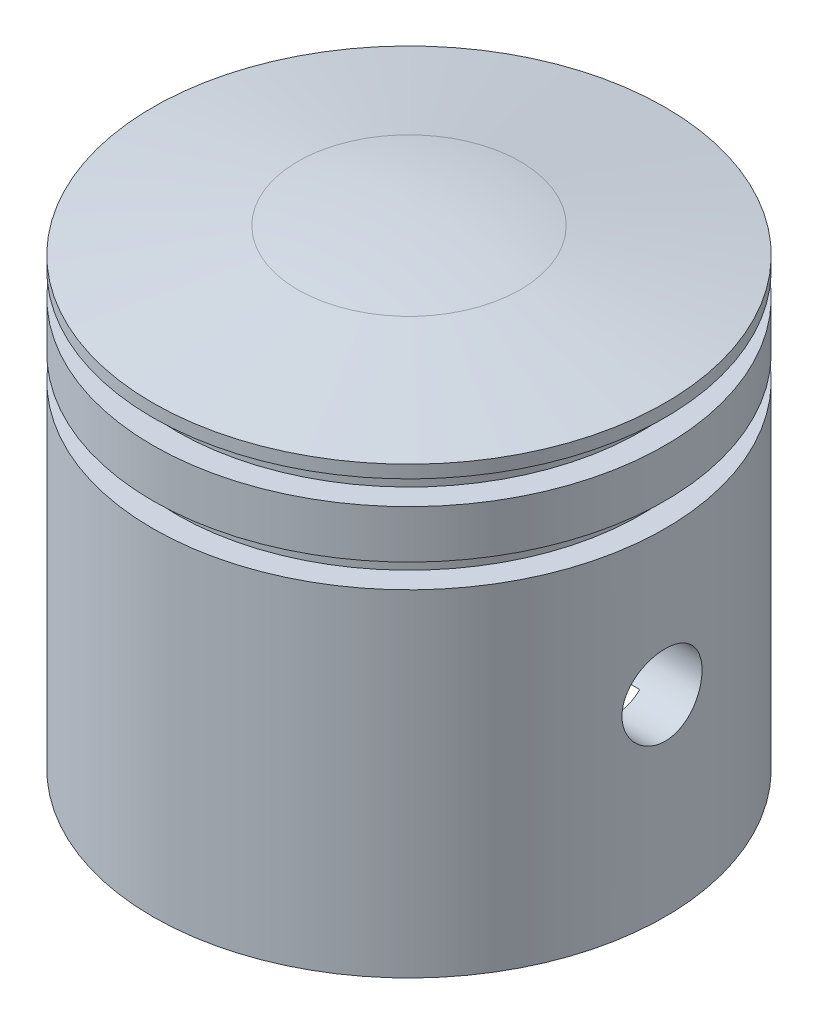
ISO-10303-21;
HEADER;
FILE_DESCRIPTION(('STEP AP214'),'2;1');
FILE_NAME('part.step','',(''),(''),'','','');
FILE_SCHEMA(('AUTOMOTIVE_DESIGN { 1 0 10303 214 1 1 1 1 }'));
ENDSEC;
DATA;
#1=APPLICATION_CONTEXT('core data for automotive mechanical design processes');
#2=APPLICATION_PROTOCOL_DEFINITION('international standard','automotive_design',2000,#1);
#3=PRODUCT_CONTEXT('',#1,'mechanical');
#4=PRODUCT('Part','Part','',(#3));
#5=PRODUCT_RELATED_PRODUCT_CATEGORY('part','',(#4));
#6=PRODUCT_DEFINITION_FORMATION('','',#4);
#7=PRODUCT_DEFINITION_CONTEXT('part definition',#1,'design');
#8=PRODUCT_DEFINITION('design','',#6,#7);
#9=PRODUCT_DEFINITION_SHAPE('','',#8);
#10=(LENGTH_UNIT() NAMED_UNIT(*) SI_UNIT(.MILLI.,.METRE.));
#11=(NAMED_UNIT(*) PLANE_ANGLE_UNIT() SI_UNIT($,.RADIAN.));
#12=(NAMED_UNIT(*) SI_UNIT($,.STERADIAN.) SOLID_ANGLE_UNIT());
#13=UNCERTAINTY_MEASURE_WITH_UNIT(LENGTH_MEASURE(1.E-05),#10,'distance_accuracy_value','');
#14=(GEOMETRIC_REPRESENTATION_CONTEXT(3) GLOBAL_UNCERTAINTY_ASSIGNED_CONTEXT((#13)) GLOBAL_UNIT_ASSIGNED_CONTEXT((#10,
#11,#12)) REPRESENTATION_CONTEXT('',''));
#15=CARTESIAN_POINT('',(0.,0.,0.));
#16=DIRECTION('',(0.,0.,1.));
#17=DIRECTION('',(1.,0.,0.));
#18=AXIS2_PLACEMENT_3D('',#15,#16,#17);
#19=CARTESIAN_POINT('',(0.,10.,0.));
#20=DIRECTION('',(0.,-1.,0.));
#21=DIRECTION('',(0.,0.,-1.));
#22=AXIS2_PLACEMENT_3D('',#19,#20,#21);
#23=PLANE('',#22);
#24=DIRECTION('',(1.,0.,0.));
#25=VECTOR('',#24,1.);
#26=CARTESIAN_POINT('',(-16.,10.,-1.5));
#27=LINE('',#26,#25);
#28=CARTESIAN_POINT('',(-12.913171570145,10.,-1.5));
#29=VERTEX_POINT('',#28);
#30=CARTESIAN_POINT('',(-9.88685996664259,10.,-1.5));
#31=VERTEX_POINT('',#30);
#32=EDGE_CURVE('E67',#29,#31,#27,.T.);
#33=ORIENTED_EDGE('',*,*,#32,.F.);
#34=CARTESIAN_POINT('',(0.,10.,0.));
#35=DIRECTION('',(0.,-1.,0.));
#36=DIRECTION('',(0.,0.,-1.));
#37=AXIS2_PLACEMENT_3D('',#34,#35,#36);
#38=CIRCLE('',#37,13.);
#39=CARTESIAN_POINT('',(12.913171570145,10.,-1.5));
#40=VERTEX_POINT('',#39);
#41=EDGE_CURVE('E270',#29,#40,#38,.T.);
#42=ORIENTED_EDGE('',*,*,#41,.T.);
#43=CARTESIAN_POINT('',(9.88685996664259,10.,-1.5));
#44=VERTEX_POINT('',#43);
#45=EDGE_CURVE('E276',#44,#40,#27,.T.);
#46=ORIENTED_EDGE('',*,*,#45,.F.);
#47=CARTESIAN_POINT('',(0.,10.,0.));
#48=DIRECTION('',(0.,-1.,0.));
#49=DIRECTION('',(0.,0.,-1.));
#50=AXIS2_PLACEMENT_3D('',#47,#48,#49);
#51=CIRCLE('',#50,10.);
#52=EDGE_CURVE('E105',#44,#31,#51,.F.);
#53=ORIENTED_EDGE('',*,*,#52,.T.);
#54=EDGE_LOOP('',(#33,#42,#46,#53));
#55=FACE_BOUND('',#54,.T.);
#56=ADVANCED_FACE('F38',(#55),#23,.T.);
#57=CARTESIAN_POINT('',(0.,30.,0.));
#58=DIRECTION('',(0.,1.,0.));
#59=DIRECTION('',(0.,0.,1.));
#60=AXIS2_PLACEMENT_3D('',#57,#58,#59);
#61=CYLINDRICAL_SURFACE('',#60,16.);
#62=CARTESIAN_POINT('',(0.,27.,0.));
#63=DIRECTION('',(0.,1.,0.));
#64=DIRECTION('',(0.,0.,1.));
#65=AXIS2_PLACEMENT_3D('',#62,#63,#64);
#66=CIRCLE('',#65,16.);
#67=CARTESIAN_POINT('',(0.,27.,16.));
#68=VERTEX_POINT('',#67);
#69=EDGE_CURVE('E237',#68,#68,#66,.T.);
#70=ORIENTED_EDGE('',*,*,#69,.T.);
#71=EDGE_LOOP('',(#70));
#72=FACE_BOUND('',#71,.T.);
#73=CARTESIAN_POINT('',(0.,27.7958327840944,0.));
#74=DIRECTION('',(0.,1.,0.));
#75=DIRECTION('',(0.,0.,1.));
#76=AXIS2_PLACEMENT_3D('',#73,#74,#75);
#77=CIRCLE('',#76,16.);
#78=CARTESIAN_POINT('',(0.,27.7958327840944,16.));
#79=VERTEX_POINT('',#78);
#80=EDGE_CURVE('E251',#79,#79,#77,.T.);
#81=ORIENTED_EDGE('',*,*,#80,.F.);
#82=EDGE_LOOP('',(#81));
#83=FACE_BOUND('',#82,.T.);
#84=ADVANCED_FACE('F158',(#72,#83),#61,.T.);
#85=CARTESIAN_POINT('',(0.,27.7958327840944,0.));
#86=DIRECTION('',(0.,-1.,0.));
#87=DIRECTION('',(0.,0.,-1.));
#88=AXIS2_PLACEMENT_3D('',#85,#86,#87);
#89=CONICAL_SURFACE('',#88,16.,1.39626340159547);
#90=CARTESIAN_POINT('',(0.,29.3923101204884,0.));
#91=DIRECTION('',(0.,1.,0.));
#92=DIRECTION('',(0.,0.,1.));
#93=AXIS2_PLACEMENT_3D('',#90,#91,#92);
#94=CIRCLE('',#93,6.94592710667697);
#95=CARTESIAN_POINT('',(0.,29.3923101204884,6.94592710667697));
#96=VERTEX_POINT('',#95);
#97=EDGE_CURVE('E248',#96,#96,#94,.T.);
#98=ORIENTED_EDGE('',*,*,#97,.F.);
#99=EDGE_LOOP('',(#98));
#100=FACE_BOUND('',#99,.T.);
#101=ORIENTED_EDGE('',*,*,#80,.T.);
#102=EDGE_LOOP('',(#101));
#103=FACE_BOUND('',#102,.T.);
#104=ADVANCED_FACE('F162',(#100,#103),#89,.T.);
#105=CARTESIAN_POINT('',(0.,-10.,0.));
#106=DIRECTION('',(0.,1.,0.));
#107=DIRECTION('',(1.,0.,0.));
#108=AXIS2_PLACEMENT_3D('',#105,#106,#107);
#109=SPHERICAL_SURFACE('',#108,40.);
#110=ORIENTED_EDGE('',*,*,#97,.T.);
#111=EDGE_LOOP('',(#110));
#112=FACE_BOUND('',#111,.T.);
#113=ADVANCED_FACE('F169',(#112),#109,.T.);
#114=CARTESIAN_POINT('',(14.5,25.5,0.));
#115=DIRECTION('',(0.,-1.,0.));
#116=DIRECTION('',(0.,0.,-1.));
#117=AXIS2_PLACEMENT_3D('',#114,#115,#116);
#118=PLANE('',#117);
#119=CARTESIAN_POINT('',(0.,25.5,0.));
#120=DIRECTION('',(0.,-1.,0.));
#121=DIRECTION('',(0.,0.,-1.));
#122=AXIS2_PLACEMENT_3D('',#119,#120,#121);
#123=CIRCLE('',#122,14.5);
#124=CARTESIAN_POINT('',(0.,25.5,-14.5));
#125=VERTEX_POINT('',#124);
#126=EDGE_CURVE('E232',#125,#125,#123,.T.);
#127=ORIENTED_EDGE('',*,*,#126,.T.);
#128=EDGE_LOOP('',(#127));
#129=FACE_BOUND('',#128,.T.);
#130=CARTESIAN_POINT('',(0.,25.5,0.));
#131=DIRECTION('',(0.,-1.,0.));
#132=DIRECTION('',(0.,0.,-1.));
#133=AXIS2_PLACEMENT_3D('',#130,#131,#132);
#134=CIRCLE('',#133,16.);
#135=CARTESIAN_POINT('',(0.,25.5,-16.));
#136=VERTEX_POINT('',#135);
#137=EDGE_CURVE('E113',#136,#136,#134,.T.);
#138=ORIENTED_EDGE('',*,*,#137,.F.);
#139=EDGE_LOOP('',(#138));
#140=FACE_BOUND('',#139,.T.);
#141=ADVANCED_FACE('F173',(#129,#140),#118,.F.);
#142=CARTESIAN_POINT('',(14.5,27.,0.));
#143=DIRECTION('',(0.,1.,0.));
#144=DIRECTION('',(0.,0.,1.));
#145=AXIS2_PLACEMENT_3D('',#142,#143,#144);
#146=PLANE('',#145);
#147=CARTESIAN_POINT('',(0.,27.,0.));
#148=DIRECTION('',(0.,-1.,0.));
#149=DIRECTION('',(0.,0.,-1.));
#150=AXIS2_PLACEMENT_3D('',#147,#148,#149);
#151=CIRCLE('',#150,14.5);
#152=CARTESIAN_POINT('',(0.,27.,-14.5));
#153=VERTEX_POINT('',#152);
#154=EDGE_CURVE('E240',#153,#153,#151,.T.);
#155=ORIENTED_EDGE('',*,*,#154,.F.);
#156=EDGE_LOOP('',(#155));
#157=FACE_BOUND('',#156,.T.);
#158=ORIENTED_EDGE('',*,*,#69,.F.);
#159=EDGE_LOOP('',(#158));
#160=FACE_BOUND('',#159,.T.);
#161=ADVANCED_FACE('F190',(#157,#160),#146,.F.);
#162=CARTESIAN_POINT('',(0.,0.,0.));
#163=DIRECTION('',(0.,-1.,0.));
#164=DIRECTION('',(0.,0.,-1.));
#165=AXIS2_PLACEMENT_3D('',#162,#163,#164);
#166=CYLINDRICAL_SURFACE('',#165,14.5);
#167=ORIENTED_EDGE('',*,*,#126,.F.);
#168=EDGE_LOOP('',(#167));
#169=FACE_BOUND('',#168,.T.);
#170=ORIENTED_EDGE('',*,*,#154,.T.);
#171=EDGE_LOOP('',(#170));
#172=FACE_BOUND('',#171,.T.);
#173=ADVANCED_FACE('F187',(#169,#172),#166,.T.);
#174=ORIENTED_EDGE('',*,*,#137,.T.);
#175=EDGE_LOOP('',(#174));
#176=FACE_BOUND('',#175,.T.);
#177=CARTESIAN_POINT('',(0.,22.5,0.));
#178=DIRECTION('',(0.,1.,0.));
#179=DIRECTION('',(0.,0.,1.));
#180=AXIS2_PLACEMENT_3D('',#177,#178,#179);
#181=CIRCLE('',#180,16.);
#182=CARTESIAN_POINT('',(0.,22.5,16.));
#183=VERTEX_POINT('',#182);
#184=EDGE_CURVE('E228',#183,#183,#181,.T.);
#185=ORIENTED_EDGE('',*,*,#184,.T.);
#186=EDGE_LOOP('',(#185));
#187=FACE_BOUND('',#186,.T.);
#188=ADVANCED_FACE('F164',(#176,#187),#61,.T.);
#189=CARTESIAN_POINT('',(14.5,21.,0.));
#190=DIRECTION('',(0.,-1.,0.));
#191=DIRECTION('',(0.,0.,-1.));
#192=AXIS2_PLACEMENT_3D('',#189,#190,#191);
#193=PLANE('',#192);
#194=CARTESIAN_POINT('',(0.,21.,0.));
#195=DIRECTION('',(0.,-1.,0.));
#196=DIRECTION('',(0.,0.,-1.));
#197=AXIS2_PLACEMENT_3D('',#194,#195,#196);
#198=CIRCLE('',#197,14.5);
#199=CARTESIAN_POINT('',(0.,21.,-14.5));
#200=VERTEX_POINT('',#199);
#201=EDGE_CURVE('E257',#200,#200,#198,.T.);
#202=ORIENTED_EDGE('',*,*,#201,.T.);
#203=EDGE_LOOP('',(#202));
#204=FACE_BOUND('',#203,.T.);
#205=CARTESIAN_POINT('',(0.,21.,0.));
#206=DIRECTION('',(0.,-1.,0.));
#207=DIRECTION('',(0.,0.,-1.));
#208=AXIS2_PLACEMENT_3D('',#205,#206,#207);
#209=CIRCLE('',#208,16.);
#210=CARTESIAN_POINT('',(0.,21.,-16.));
#211=VERTEX_POINT('',#210);
#212=EDGE_CURVE('E231',#211,#211,#209,.T.);
#213=ORIENTED_EDGE('',*,*,#212,.F.);
#214=EDGE_LOOP('',(#213));
#215=FACE_BOUND('',#214,.T.);
#216=ADVANCED_FACE('F180',(#204,#215),#193,.F.);
#217=CARTESIAN_POINT('',(14.5,22.5,0.));
#218=DIRECTION('',(0.,1.,0.));
#219=DIRECTION('',(0.,0.,1.));
#220=AXIS2_PLACEMENT_3D('',#217,#218,#219);
#221=PLANE('',#220);
#222=CARTESIAN_POINT('',(0.,22.5,0.));
#223=DIRECTION('',(0.,-1.,0.));
#224=DIRECTION('',(0.,0.,-1.));
#225=AXIS2_PLACEMENT_3D('',#222,#223,#224);
#226=CIRCLE('',#225,14.5);
#227=CARTESIAN_POINT('',(0.,22.5,-14.5));
#228=VERTEX_POINT('',#227);
#229=EDGE_CURVE('E110',#228,#228,#226,.T.);
#230=ORIENTED_EDGE('',*,*,#229,.F.);
#231=EDGE_LOOP('',(#230));
#232=FACE_BOUND('',#231,.T.);
#233=ORIENTED_EDGE('',*,*,#184,.F.);
#234=EDGE_LOOP('',(#233));
#235=FACE_BOUND('',#234,.T.);
#236=ADVANCED_FACE('F178',(#232,#235),#221,.F.);
#237=CARTESIAN_POINT('',(0.,0.,0.));
#238=DIRECTION('',(0.,-1.,0.));
#239=DIRECTION('',(0.,0.,-1.));
#240=AXIS2_PLACEMENT_3D('',#237,#238,#239);
#241=CYLINDRICAL_SURFACE('',#240,14.5);
#242=ORIENTED_EDGE('',*,*,#201,.F.);
#243=EDGE_LOOP('',(#242));
#244=FACE_BOUND('',#243,.T.);
#245=ORIENTED_EDGE('',*,*,#229,.T.);
#246=EDGE_LOOP('',(#245));
#247=FACE_BOUND('',#246,.T.);
#248=ADVANCED_FACE('F175',(#244,#247),#241,.T.);
#249=CARTESIAN_POINT('',(0.,0.,0.));
#250=DIRECTION('',(0.,1.,0.));
#251=DIRECTION('',(0.,0.,1.));
#252=AXIS2_PLACEMENT_3D('',#249,#250,#251);
#253=PLANE('',#252);
#254=CARTESIAN_POINT('',(0.,0.,0.));
#255=DIRECTION('',(0.,-1.,0.));
#256=DIRECTION('',(0.,0.,-1.));
#257=AXIS2_PLACEMENT_3D('',#254,#255,#256);
#258=CIRCLE('',#257,13.);
#259=CARTESIAN_POINT('',(0.,0.,-13.));
#260=VERTEX_POINT('',#259);
#261=EDGE_CURVE('E267',#260,#260,#258,.T.);
#262=ORIENTED_EDGE('',*,*,#261,.F.);
#263=EDGE_LOOP('',(#262));
#264=FACE_BOUND('',#263,.T.);
#265=CARTESIAN_POINT('',(0.,0.,0.));
#266=DIRECTION('',(0.,1.,0.));
#267=DIRECTION('',(0.,0.,1.));
#268=AXIS2_PLACEMENT_3D('',#265,#266,#267);
#269=CIRCLE('',#268,16.);
#270=CARTESIAN_POINT('',(0.,0.,16.));
#271=VERTEX_POINT('',#270);
#272=EDGE_CURVE('E92',#271,#271,#269,.T.);
#273=ORIENTED_EDGE('',*,*,#272,.F.);
#274=EDGE_LOOP('',(#273));
#275=FACE_BOUND('',#274,.T.);
#276=ADVANCED_FACE('F40',(#264,#275),#253,.F.);
#277=CARTESIAN_POINT('',(-16.,14.5,0.));
#278=CARTESIAN_POINT('',(-15.9999977019448,14.4999943017285,0.139515097271033));
#279=CARTESIAN_POINT('',(-15.9981561248574,14.4882818862264,0.279109404865704));
#280=CARTESIAN_POINT('',(-15.9909869809759,14.4417563087232,0.554391314978102));
#281=CARTESIAN_POINT('',(-15.9856560884472,14.4069211074965,0.690075061323317));
#282=CARTESIAN_POINT('',(-15.9721069716578,14.3152203371934,0.953512538047404));
#283=CARTESIAN_POINT('',(-15.9638909956317,14.2583719186384,1.0812723522899));
#284=CARTESIAN_POINT('',(-15.9454779403815,14.1243014548584,1.3254212510446));
#285=CARTESIAN_POINT('',(-15.9352811186255,14.0470820569641,1.44181181036831));
#286=CARTESIAN_POINT('',(-15.9139426841436,13.873766951646,1.66091991165162));
#287=CARTESIAN_POINT('',(-15.9027945139234,13.7775330051098,1.76352747914264));
#288=CARTESIAN_POINT('',(-15.8808607613029,13.5692180517311,1.95120768822823));
#289=CARTESIAN_POINT('',(-15.8700752005075,13.4571361026998,2.03627928654192));
#290=CARTESIAN_POINT('',(-15.8500242812744,13.2195617286563,2.18690544328884));
#291=CARTESIAN_POINT('',(-15.840767397861,13.0940005176382,2.25235273557992));
#292=CARTESIAN_POINT('',(-15.8249120174236,12.8334985891422,2.36118681597065));
#293=CARTESIAN_POINT('',(-15.8183133630222,12.6985584274894,2.40457491010063));
#294=CARTESIAN_POINT('',(-15.8085863451104,12.4242890988562,2.46771559322167));
#295=CARTESIAN_POINT('',(-15.8054302653236,12.2850044141812,2.48765705487496));
#296=CARTESIAN_POINT('',(-15.8028617107177,12.0050328111074,2.50392369757622));
#297=CARTESIAN_POINT('',(-15.8034490028802,11.864345980534,2.50025034860466));
#298=CARTESIAN_POINT('',(-15.8082755045521,11.5869029681473,2.4695458080889));
#299=CARTESIAN_POINT('',(-15.8124817218495,11.4501227766469,2.44272562959693));
#300=CARTESIAN_POINT('',(-15.8240205634547,11.1830279936407,2.36681937833752));
#301=CARTESIAN_POINT('',(-15.8313532830641,11.0527135993595,2.31773262684132));
#302=CARTESIAN_POINT('',(-15.8483550685462,10.8016112873228,2.19846916949384));
#303=CARTESIAN_POINT('',(-15.8580339308724,10.6808662082269,2.12820372315549));
#304=CARTESIAN_POINT('',(-15.878630461501,10.4528004643145,1.96864058146637));
#305=CARTESIAN_POINT('',(-15.8895482178821,10.3454807551125,1.87934153253017));
#306=CARTESIAN_POINT('',(-15.911537862489,10.1460897533667,1.68309088822333));
#307=CARTESIAN_POINT('',(-15.9226101363559,10.0541968417305,1.57595800560539));
#308=CARTESIAN_POINT('',(-15.9435512534783,9.8896668543601,1.34769694737936));
#309=CARTESIAN_POINT('',(-15.9534200906202,9.81702987644317,1.22656870068132));
#310=CARTESIAN_POINT('',(-15.9708539902704,9.69306192657761,0.973595927056491));
#311=CARTESIAN_POINT('',(-15.9784174854193,9.641745441467,0.841744186240459));
#312=CARTESIAN_POINT('',(-15.9903756000068,9.56203403255277,0.571149534696758));
#313=CARTESIAN_POINT('',(-15.9947704520898,9.53363742593352,0.4324071306872));
#314=CARTESIAN_POINT('',(-15.9998651172728,9.50081072354981,0.153508336763735));
#315=CARTESIAN_POINT('',(-16.0006027179286,9.49613552102382,0.013381461508702));
#316=CARTESIAN_POINT('',(-15.9984028649127,9.51023270533598,-0.265654546411642));
#317=CARTESIAN_POINT('',(-15.9954655349964,9.52900430258911,-0.404563719925156));
#318=CARTESIAN_POINT('',(-15.9862692369322,9.58925838768018,-0.676473446265705));
#319=CARTESIAN_POINT('',(-15.9800278421539,9.63062075826773,-0.809501262056041));
#320=CARTESIAN_POINT('',(-15.9649207568356,9.73475509439879,-1.06673406785663));
#321=CARTESIAN_POINT('',(-15.9560549341007,9.79752813844267,-1.19093861303941));
#322=CARTESIAN_POINT('',(-15.9365897274094,9.94327199112658,-1.42807220225041));
#323=CARTESIAN_POINT('',(-15.9259772866342,10.0263974200905,-1.54090512378373));
#324=CARTESIAN_POINT('',(-15.9042388046444,10.2102720859078,-1.75110696507806));
#325=CARTESIAN_POINT('',(-15.8931127309268,10.3110224392049,-1.84847490447018));
#326=CARTESIAN_POINT('',(-15.8714802753665,10.5283811972172,-2.02588080776691));
#327=CARTESIAN_POINT('',(-15.860980411908,10.6451248471223,-2.10575398584126));
#328=CARTESIAN_POINT('',(-15.8419069280583,10.8905160736613,-2.2447556772664));
#329=CARTESIAN_POINT('',(-15.83333325222,11.0191633074895,-2.30388478778105));
#330=CARTESIAN_POINT('',(-15.8191307135236,11.2842296407142,-2.39946771944995));
#331=CARTESIAN_POINT('',(-15.8134908234896,11.4206174687656,-2.43600654947912));
#332=CARTESIAN_POINT('',(-15.8057657028079,11.697689143664,-2.48564122040535));
#333=CARTESIAN_POINT('',(-15.8036802038444,11.838372665419,-2.49873883084997));
#334=CARTESIAN_POINT('',(-15.8033105804488,12.1183987159075,-2.50107452690756));
#335=CARTESIAN_POINT('',(-15.804985160429,12.2577390969335,-2.49057180548425));
#336=CARTESIAN_POINT('',(-15.8118569894183,12.5326452971443,-2.44656223255901));
#337=CARTESIAN_POINT('',(-15.8170542307995,12.6682111245017,-2.41305543086961));
#338=CARTESIAN_POINT('',(-15.830370888549,12.9316378266405,-2.32408329891852));
#339=CARTESIAN_POINT('',(-15.8384876895341,13.0595054782584,-2.26863761738581));
#340=CARTESIAN_POINT('',(-15.856731840474,13.3041656136763,-2.13738768546417));
#341=CARTESIAN_POINT('',(-15.8668592701083,13.4209576582884,-2.06158262820886));
#342=CARTESIAN_POINT('',(-15.8881156809226,13.6414655441268,-1.8908300813908));
#343=CARTESIAN_POINT('',(-15.8992540116029,13.7450321966138,-1.79569107094768));
#344=CARTESIAN_POINT('',(-15.9212004364073,13.9348212363867,-1.58937594638204));
#345=CARTESIAN_POINT('',(-15.9320084534012,14.0210395985919,-1.47819612078432));
#346=CARTESIAN_POINT('',(-15.952151024567,14.1741512230316,-1.24216685884341));
#347=CARTESIAN_POINT('',(-15.9614763443027,14.2409253727596,-1.11723937214238));
#348=CARTESIAN_POINT('',(-15.9775125983888,14.3524409961929,-0.857851882357784));
#349=CARTESIAN_POINT('',(-15.9842262014212,14.3972049725584,-0.723401776581762));
#350=CARTESIAN_POINT('',(-15.9927744586488,14.4534330210906,-0.490314239911593));
#351=CARTESIAN_POINT('',(-15.9954699162612,14.470868490629,-0.393105575651624));
#352=CARTESIAN_POINT('',(-15.9990834869762,14.4941539133791,-0.197277797850582));
#353=CARTESIAN_POINT('',(-16.0000016250796,14.5000040295573,-0.0986587041691184));
#354=CARTESIAN_POINT('',(-16.,14.5,0.));
#355=B_SPLINE_CURVE_WITH_KNOTS('',3,(#277,#278,#279,#280,#281,#282,#283,#284,#285,#286,#287,
#288,#289,#290,#291,#292,#293,#294,#295,#296,#297,#298,#299,#300,#301,#302,#303,#304,#305,#306,
#307,#308,#309,#310,#311,#312,#313,#314,#315,#316,#317,#318,#319,#320,#321,#322,#323,#324,#325,
#326,#327,#328,#329,#330,#331,#332,#333,#334,#335,#336,#337,#338,#339,#340,#341,#342,#343,#344,
#345,#346,#347,#348,#349,#350,#351,#352,#353,#354),.UNSPECIFIED.,.T.,.F.,(4,2,2,2,2,2,2,2,2,2,2,
2,2,2,2,2,2,2,2,2,2,2,2,2,2,2,2,2,2,2,2,2,2,2,2,2,2,2,4),(0.,0.418184740477491,
0.836768642528014,1.25502707944103,1.6732311879203,2.09459568152199,2.51598523645422,
2.93963778605759,3.36326525009238,3.78345631134994,4.20362121670545,4.6199957602258,
5.0363829965105,5.45453977402347,5.87272629892069,6.29545732334367,6.71819049513827,
7.14121043754565,7.56419931829866,7.98280854005914,8.40140366528356,8.81779444756567,
9.23420620742031,9.65388541469672,10.0735912160142,10.4970948024959,10.9205861964898,
11.3424741039513,11.764330162293,12.1815758159869,12.598820566189,13.0156924696662,
13.4325808967135,13.8538201231554,14.275156971423,14.6990230419984,15.1224548565628,
15.4181801635154,15.7139013105871),.UNSPECIFIED.);
#356=CARTESIAN_POINT('',(-16.,14.5,0.));
#357=VERTEX_POINT('',#356);
#358=EDGE_CURVE('E153',#357,#357,#355,.T.);
#359=ORIENTED_EDGE('',*,*,#358,.T.);
#360=EDGE_LOOP('',(#359));
#361=FACE_BOUND('',#360,.T.);
#362=CARTESIAN_POINT('',(15.8034806292791,12.,-2.5));
#363=CARTESIAN_POINT('',(15.8034830346332,11.860496621659,-2.49999429179104));
#364=CARTESIAN_POINT('',(15.8053478026579,11.7209140023147,-2.48828377742084));
#365=CARTESIAN_POINT('',(15.8125997089632,11.4456563709971,-2.44176643645043));
#366=CARTESIAN_POINT('',(15.8179902148259,11.3099852245206,-2.40693752801736));
#367=CARTESIAN_POINT('',(15.8316684916183,11.0465744103556,-2.31525516047132));
#368=CARTESIAN_POINT('',(15.8399539668268,10.9188285521292,-2.25841914921922));
#369=CARTESIAN_POINT('',(15.8584858981599,10.6747031091579,-2.12437791816389));
#370=CARTESIAN_POINT('',(15.8687321022282,10.5583220663405,-2.04717531605122));
#371=CARTESIAN_POINT('',(15.8901303851737,10.3392035148487,-1.87387730110911));
#372=CARTESIAN_POINT('',(15.9012888784461,10.2365789256004,-1.777639886175));
#373=CARTESIAN_POINT('',(15.9231973082665,10.0488657795701,-1.56931080987672));
#374=CARTESIAN_POINT('',(15.9339472216983,9.96377821377571,-1.45721825316848));
#375=CARTESIAN_POINT('',(15.9538946715316,9.81313512295885,-1.21963429185761));
#376=CARTESIAN_POINT('',(15.9630838016344,9.74768399602554,-1.09407592635729));
#377=CARTESIAN_POINT('',(15.978803149105,9.63884204527492,-0.833580171794756));
#378=CARTESIAN_POINT('',(15.9853335186778,9.59544995861733,-0.698643320136811));
#379=CARTESIAN_POINT('',(15.9949542857973,9.53230128104384,-0.424385325448812));
#380=CARTESIAN_POINT('',(15.9980722260505,9.51235535093165,-0.285108760160752));
#381=CARTESIAN_POINT('',(16.0006113098095,9.49607695669663,-0.00515314355067117));
#382=CARTESIAN_POINT('',(16.0000326754547,9.49974307364815,0.135525822989186));
#383=CARTESIAN_POINT('',(15.9952657389868,9.53043592627786,0.413000089722151));
#384=CARTESIAN_POINT('',(15.9911089169598,9.55725893884032,0.549818542575174));
#385=CARTESIAN_POINT('',(15.9796877395528,9.63318402862262,0.816988375343491));
#386=CARTESIAN_POINT('',(15.9724232987387,9.68228671835413,0.947339577352174));
#387=CARTESIAN_POINT('',(15.9555491842028,9.80158365586005,1.19848742679247));
#388=CARTESIAN_POINT('',(15.9459300777042,9.87186300542795,1.31924299071837));
#389=CARTESIAN_POINT('',(15.9254174702046,10.0314560806292,1.54732385653213));
#390=CARTESIAN_POINT('',(15.9145238783282,10.120771163955,1.65464819959324));
#391=CARTESIAN_POINT('',(15.8925387825556,10.3170334870733,1.85402198520023));
#392=CARTESIAN_POINT('',(15.8814464071021,10.4241586663949,1.94589625613075));
#393=CARTESIAN_POINT('',(15.8604269384475,10.6523975646821,2.11039226047485));
#394=CARTESIAN_POINT('',(15.8504998536298,10.7735113842741,2.18301385538335));
#395=CARTESIAN_POINT('',(15.8329349281613,11.0264796281058,2.30697060635685));
#396=CARTESIAN_POINT('',(15.8252991458489,11.1583435750735,2.35828663884161));
#397=CARTESIAN_POINT('',(15.8132168990948,11.4289648487055,2.43799343127668));
#398=CARTESIAN_POINT('',(15.8087701897074,11.5677216450697,2.46638595195258));
#399=CARTESIAN_POINT('',(15.8036163696886,11.8466281032752,2.49919719237856));
#400=CARTESIAN_POINT('',(15.80287044806,11.9867478001948,2.50386473411271));
#401=CARTESIAN_POINT('',(15.8050994977182,12.2657676352979,2.48975479033184));
#402=CARTESIAN_POINT('',(15.8080743433524,12.4046678145059,2.47097809654328));
#403=CARTESIAN_POINT('',(15.8173740105186,12.6765278074665,2.41072412555896));
#404=CARTESIAN_POINT('',(15.8236803883335,12.8095159986396,2.36937178781979));
#405=CARTESIAN_POINT('',(15.8389172439685,13.0666739711039,2.26527072241932));
#406=CARTESIAN_POINT('',(15.8478478614411,13.190843282649,2.20252085602949));
#407=CARTESIAN_POINT('',(15.8674179220711,13.4279512816488,2.05681199170293));
#408=CARTESIAN_POINT('',(15.8780706945976,13.5407902289,1.97369251093471));
#409=CARTESIAN_POINT('',(15.8998450469621,13.7510069808482,1.78982593995283));
#410=CARTESIAN_POINT('',(15.9109666556111,13.848383833607,1.6890777652142));
#411=CARTESIAN_POINT('',(15.9325473887455,14.0258112706355,1.47171546765808));
#412=CARTESIAN_POINT('',(15.9429995842164,14.1056965764301,1.35496564158984));
#413=CARTESIAN_POINT('',(15.9619548934084,14.2447195199902,1.10955861029337));
#414=CARTESIAN_POINT('',(15.9704580640831,14.3038577640459,0.980901753162492));
#415=CARTESIAN_POINT('',(15.9845269767683,14.3994462752842,0.715839663778327));
#416=CARTESIAN_POINT('',(15.9901042225572,14.4359854974394,0.579467147617089));
#417=CARTESIAN_POINT('',(15.9977412978946,14.4856261326728,0.302427949770746));
#418=CARTESIAN_POINT('',(15.9998013804089,14.498729231356,0.161761577654431));
#419=CARTESIAN_POINT('',(16.0001691012796,14.5010818526552,-0.118272165188271));
#420=CARTESIAN_POINT('',(15.9985164403994,14.4905837446428,-0.257637428859786));
#421=CARTESIAN_POINT('',(15.9917247801431,14.4465746838196,-0.532594595464882));
#422=CARTESIAN_POINT('',(15.9865857947973,14.4130638236216,-0.668186513581641));
#423=CARTESIAN_POINT('',(15.9733964142131,14.3240727402876,-0.931668850429401));
#424=CARTESIAN_POINT('',(15.965348528289,14.2686114484191,-1.05956579651625));
#425=CARTESIAN_POINT('',(15.947223323121,14.137321161478,-1.30427807253219));
#426=CARTESIAN_POINT('',(15.9371459268214,14.0614913930258,-1.42109298145458));
#427=CARTESIAN_POINT('',(15.9159528222148,13.8907105567916,-1.64160219185804));
#428=CARTESIAN_POINT('',(15.9048276353277,13.795573685696,-1.745151694824));
#429=CARTESIAN_POINT('',(15.8828612878644,13.5892700426646,-1.93490712736947));
#430=CARTESIAN_POINT('',(15.8720201944801,13.4780995182753,-2.02110898563013));
#431=CARTESIAN_POINT('',(15.8517779742959,13.2420788957246,-2.17420151541622));
#432=CARTESIAN_POINT('',(15.842386091806,13.1171490413903,-2.24097044145097));
#433=CARTESIAN_POINT('',(15.8262143333515,12.85775678237,-2.35247565604314));
#434=CARTESIAN_POINT('',(15.8194317848938,12.7233042988834,-2.3972345005847));
#435=CARTESIAN_POINT('',(15.8107909670081,12.4902302603036,-2.45344906957713));
#436=CARTESIAN_POINT('',(15.8080643798014,12.3930384000151,-2.47087849275467));
#437=CARTESIAN_POINT('',(15.804408373768,12.1972442189536,-2.49415589078729));
#438=CARTESIAN_POINT('',(15.8034789284691,12.0986419189782,-2.50000403623692));
#439=CARTESIAN_POINT('',(15.8034806292791,12.,-2.5));
#440=B_SPLINE_CURVE_WITH_KNOTS('',3,(#362,#363,#364,#365,#366,#367,#368,#369,#370,#371,#372,
#373,#374,#375,#376,#377,#378,#379,#380,#381,#382,#383,#384,#385,#386,#387,#388,#389,#390,#391,
#392,#393,#394,#395,#396,#397,#398,#399,#400,#401,#402,#403,#404,#405,#406,#407,#408,#409,#410,
#411,#412,#413,#414,#415,#416,#417,#418,#419,#420,#421,#422,#423,#424,#425,#426,#427,#428,#429,
#430,#431,#432,#433,#434,#435,#436,#437,#438,#439),.UNSPECIFIED.,.T.,.F.,(4,2,2,2,2,2,2,2,2,2,2,
2,2,2,2,2,2,2,2,2,2,2,2,2,2,2,2,2,2,2,2,2,2,2,2,2,2,2,4),(0.,0.418149527902241,
0.836699032574077,1.25491737645053,1.67308199345223,2.09449258051085,2.51592697424482,
2.93956378022295,3.36317633102573,3.78334397517517,4.20348637030326,4.61996979150785,
5.03646466334576,5.45465612930833,5.87287743207563,6.29556043395287,6.71824647655855,
7.14131110038651,7.56434322607052,7.98292940034458,8.40150143908463,8.81778013452042,
9.23408098683358,9.65377352836981,10.0734918986585,10.4970197199928,10.9205351635679,
11.3423727623224,11.7641800198745,12.18149834073,12.5988149821383,13.0157724881518,
13.432745828047,13.8539404040181,14.275233715164,14.6991122166338,15.1225554163993,
15.4182305458031,15.7139013198205),.UNSPECIFIED.);
#441=CARTESIAN_POINT('',(15.8034806292791,12.,-2.5));
#442=VERTEX_POINT('',#441);
#443=EDGE_CURVE('E147',#442,#442,#440,.T.);
#444=ORIENTED_EDGE('',*,*,#443,.T.);
#445=EDGE_LOOP('',(#444));
#446=FACE_BOUND('',#445,.T.);
#447=ORIENTED_EDGE('',*,*,#212,.T.);
#448=EDGE_LOOP('',(#447));
#449=FACE_BOUND('',#448,.T.);
#450=ORIENTED_EDGE('',*,*,#272,.T.);
#451=EDGE_LOOP('',(#450));
#452=FACE_BOUND('',#451,.T.);
#453=ADVANCED_FACE('F165',(#361,#446,#449,#452),#61,.T.);
#454=DIRECTION('',(1.,0.,0.));
#455=VECTOR('',#454,1.);
#456=CARTESIAN_POINT('',(-16.,10.,1.5));
#457=LINE('',#456,#455);
#458=CARTESIAN_POINT('',(12.913171570145,10.,1.5));
#459=VERTEX_POINT('',#458);
#460=CARTESIAN_POINT('',(9.88685996664259,10.,1.5));
#461=VERTEX_POINT('',#460);
#462=EDGE_CURVE('E60',#459,#461,#457,.F.);
#463=ORIENTED_EDGE('',*,*,#462,.F.);
#464=CARTESIAN_POINT('',(-12.913171570145,10.,1.5));
#465=VERTEX_POINT('',#464);
#466=EDGE_CURVE('E99',#459,#465,#38,.T.);
#467=ORIENTED_EDGE('',*,*,#466,.T.);
#468=CARTESIAN_POINT('',(-9.88685996664259,10.,1.5));
#469=VERTEX_POINT('',#468);
#470=EDGE_CURVE('E85',#469,#465,#457,.F.);
#471=ORIENTED_EDGE('',*,*,#470,.F.);
#472=EDGE_CURVE('E97',#469,#461,#51,.F.);
#473=ORIENTED_EDGE('',*,*,#472,.T.);
#474=EDGE_LOOP('',(#463,#467,#471,#473));
#475=FACE_BOUND('',#474,.T.);
#476=ADVANCED_FACE('F96',(#475),#23,.T.);
#477=CARTESIAN_POINT('',(0.,10.,0.));
#478=DIRECTION('',(0.,-1.,0.));
#479=DIRECTION('',(0.,0.,-1.));
#480=AXIS2_PLACEMENT_3D('',#477,#478,#479);
#481=CYLINDRICAL_SURFACE('',#480,13.);
#482=ORIENTED_EDGE('',*,*,#41,.F.);
#483=CARTESIAN_POINT('',(-12.913171570145,10.,-1.5));
#484=CARTESIAN_POINT('',(-12.9196464939997,9.95820085358915,-1.44426579878659));
#485=CARTESIAN_POINT('',(-12.9259549192278,9.91874092086907,-1.38679796540747));
#486=CARTESIAN_POINT('',(-12.9380773902685,9.84473133764257,-1.26873073828123));
#487=CARTESIAN_POINT('',(-12.9438914163828,9.81018188274731,-1.20813121991303));
#488=CARTESIAN_POINT('',(-12.9603404608392,9.71430178140072,-1.02224257355282));
#489=CARTESIAN_POINT('',(-12.9699930765876,9.66067330241013,-0.892775127826518));
#490=CARTESIAN_POINT('',(-12.9855839172602,9.57571702553779,-0.626442746105629));
#491=CARTESIAN_POINT('',(-12.9915189085937,9.54440863841842,-0.489571482352221));
#492=CARTESIAN_POINT('',(-12.9990013032835,9.50512260914373,-0.212467802603064));
#493=CARTESIAN_POINT('',(-13.0005515461425,9.49712986799228,-0.0722376211678123));
#494=CARTESIAN_POINT('',(-12.9991042541622,9.50466026890764,0.206029683769606));
#495=CARTESIAN_POINT('',(-12.996155887224,9.51992916830979,0.344074092382287));
#496=CARTESIAN_POINT('',(-12.986125153176,9.57304239783094,0.615650842540818));
#497=CARTESIAN_POINT('',(-12.9790411747057,9.61089552758196,0.749181403888349));
#498=CARTESIAN_POINT('',(-12.9627490398878,9.70119099514041,0.989738928879762));
#499=CARTESIAN_POINT('',(-12.9539797808047,9.75083257474323,1.09785208331175));
#500=CARTESIAN_POINT('',(-12.9395107443663,9.83627154609569,1.25371177293855));
#501=CARTESIAN_POINT('',(-12.9344702910731,9.86656964555138,1.30459866498264));
#502=CARTESIAN_POINT('',(-12.9240502172861,9.9306832908871,1.4040757561164));
#503=CARTESIAN_POINT('',(-12.9186705698196,9.96449911663509,1.45266577202019));
#504=CARTESIAN_POINT('',(-12.913171570145,10.,1.5));
#505=B_SPLINE_CURVE_WITH_KNOTS('',3,(#483,#484,#485,#486,#487,#488,#489,#490,#491,#492,#493,
#494,#495,#496,#497,#498,#499,#500,#501,#502,#503,#504),.UNSPECIFIED.,.F.,.F.,(4,2,2,2,2,2,2,2,
2,2,4),(0.,0.209776062140149,0.419560478466375,0.838801230764256,1.25840613426738,
1.67773924513587,2.09252194041192,2.50746635565219,2.86404950501363,3.04223164009906,
3.22042796209395),.UNSPECIFIED.);
#506=EDGE_CURVE('E134',#29,#465,#505,.T.);
#507=ORIENTED_EDGE('',*,*,#506,.T.);
#508=ORIENTED_EDGE('',*,*,#466,.F.);
#509=CARTESIAN_POINT('',(12.913171570145,10.,1.5));
#510=CARTESIAN_POINT('',(12.9196464939997,9.95820085358915,1.44426579878659));
#511=CARTESIAN_POINT('',(12.9259549192278,9.91874092086907,1.38679796540747));
#512=CARTESIAN_POINT('',(12.9380773902685,9.84473133764257,1.26873073828123));
#513=CARTESIAN_POINT('',(12.9438914163828,9.81018188274731,1.20813121991303));
#514=CARTESIAN_POINT('',(12.9603404608392,9.71430178140072,1.02224257355282));
#515=CARTESIAN_POINT('',(12.9699930765876,9.66067330241013,0.892775127826518));
#516=CARTESIAN_POINT('',(12.9855839172602,9.57571702553779,0.626442746105629));
#517=CARTESIAN_POINT('',(12.9915189085937,9.54440863841842,0.489571482352221));
#518=CARTESIAN_POINT('',(12.9990013032835,9.50512260914373,0.212467802603064));
#519=CARTESIAN_POINT('',(13.0005515461425,9.49712986799228,0.0722376211678123));
#520=CARTESIAN_POINT('',(12.9991042541622,9.50466026890764,-0.206029683769606));
#521=CARTESIAN_POINT('',(12.996155887224,9.51992916830979,-0.344074092382287));
#522=CARTESIAN_POINT('',(12.986125153176,9.57304239783094,-0.615650842540818));
#523=CARTESIAN_POINT('',(12.9790411747057,9.61089552758196,-0.749181403888349));
#524=CARTESIAN_POINT('',(12.9627490398878,9.70119099514041,-0.989738928879762));
#525=CARTESIAN_POINT('',(12.9539797808047,9.75083257474323,-1.09785208331175));
#526=CARTESIAN_POINT('',(12.9395107443663,9.83627154609569,-1.25371177293855));
#527=CARTESIAN_POINT('',(12.9344702910731,9.86656964555138,-1.30459866498264));
#528=CARTESIAN_POINT('',(12.9240502172861,9.9306832908871,-1.4040757561164));
#529=CARTESIAN_POINT('',(12.9186705698196,9.96449911663509,-1.45266577202019));
#530=CARTESIAN_POINT('',(12.913171570145,10.,-1.5));
#531=B_SPLINE_CURVE_WITH_KNOTS('',3,(#509,#510,#511,#512,#513,#514,#515,#516,#517,#518,#519,
#520,#521,#522,#523,#524,#525,#526,#527,#528,#529,#530),.UNSPECIFIED.,.F.,.F.,(4,2,2,2,2,2,2,2,
2,2,4),(0.,0.209776062140149,0.419560478466375,0.838801230764256,1.25840613426738,
1.67773924513587,2.09252194041192,2.50746635565219,2.86404950501363,3.04223164009906,
3.22042796209395),.UNSPECIFIED.);
#532=EDGE_CURVE('E141',#459,#40,#531,.T.);
#533=ORIENTED_EDGE('',*,*,#532,.T.);
#534=EDGE_LOOP('',(#482,#507,#508,#533));
#535=FACE_BOUND('',#534,.T.);
#536=ORIENTED_EDGE('',*,*,#261,.T.);
#537=EDGE_LOOP('',(#536));
#538=FACE_BOUND('',#537,.T.);
#539=ADVANCED_FACE('F205',(#535,#538),#481,.F.);
#540=CARTESIAN_POINT('',(0.,24.,0.));
#541=DIRECTION('',(0.,-1.,0.));
#542=DIRECTION('',(0.,0.,-1.));
#543=AXIS2_PLACEMENT_3D('',#540,#541,#542);
#544=PLANE('',#543);
#545=CARTESIAN_POINT('',(0.,24.,0.));
#546=DIRECTION('',(0.,-1.,0.));
#547=DIRECTION('',(0.,0.,-1.));
#548=AXIS2_PLACEMENT_3D('',#545,#546,#547);
#549=CIRCLE('',#548,10.);
#550=CARTESIAN_POINT('',(0.,24.,-10.));
#551=VERTEX_POINT('',#550);
#552=EDGE_CURVE('E104',#551,#551,#549,.T.);
#553=ORIENTED_EDGE('',*,*,#552,.T.);
#554=EDGE_LOOP('',(#553));
#555=FACE_BOUND('',#554,.T.);
#556=ADVANCED_FACE('F210',(#555),#544,.T.);
#557=CARTESIAN_POINT('',(0.,24.,0.));
#558=DIRECTION('',(0.,-1.,0.));
#559=DIRECTION('',(0.,0.,-1.));
#560=AXIS2_PLACEMENT_3D('',#557,#558,#559);
#561=CYLINDRICAL_SURFACE('',#560,10.);
#562=ORIENTED_EDGE('',*,*,#552,.F.);
#563=EDGE_LOOP('',(#562));
#564=FACE_BOUND('',#563,.T.);
#565=ORIENTED_EDGE('',*,*,#52,.F.);
#566=CARTESIAN_POINT('',(9.88685996664259,10.,-1.5));
#567=CARTESIAN_POINT('',(9.87829702632978,10.0423381044855,-1.55644775774642));
#568=CARTESIAN_POINT('',(9.8695164098382,10.0870272455987,-1.61105469283506));
#569=CARTESIAN_POINT('',(9.85176215376839,10.1808382203519,-1.71628235343695));
#570=CARTESIAN_POINT('',(9.84278851814074,10.2299599633339,-1.76690316043694));
#571=CARTESIAN_POINT('',(9.8159502550057,10.3835199248386,-1.91228287155091));
#572=CARTESIAN_POINT('',(9.79815893076327,10.4941971430423,-2.00061796766923));
#573=CARTESIAN_POINT('',(9.76481433608198,10.7291280421412,-2.15751587055995));
#574=CARTESIAN_POINT('',(9.74926267017561,10.8533913453404,-2.22606453693198));
#575=CARTESIAN_POINT('',(9.72224025261607,11.1120506879739,-2.34127318968291));
#576=CARTESIAN_POINT('',(9.7107671007491,11.246440711182,-2.38794605518357));
#577=CARTESIAN_POINT('',(9.6934351616116,11.5194319951237,-2.45735418339059));
#578=CARTESIAN_POINT('',(9.6874935617474,11.6579379985205,-2.48044304897375));
#579=CARTESIAN_POINT('',(9.68165898643259,11.937005984586,-2.50312290551809));
#580=CARTESIAN_POINT('',(9.68176622057743,12.0775680383293,-2.50271308223672));
#581=CARTESIAN_POINT('',(9.68793593914431,12.3529816746888,-2.47871632829885));
#582=CARTESIAN_POINT('',(9.69384866853871,12.4878879868879,-2.45571222118534));
#583=CARTESIAN_POINT('',(9.71071117534564,12.7518469398539,-2.38815579017542));
#584=CARTESIAN_POINT('',(9.72166092471398,12.8808996132072,-2.34360358625042));
#585=CARTESIAN_POINT('',(9.74746560596719,13.1307885670213,-2.23385335557449));
#586=CARTESIAN_POINT('',(9.7623529195144,13.2515457436194,-2.16848317197037));
#587=CARTESIAN_POINT('',(9.79434578612789,13.4805714327983,-2.01906213967446));
#588=CARTESIAN_POINT('',(9.81145177041249,13.5888375098736,-1.93500765725064));
#589=CARTESIAN_POINT('',(9.84655716119831,13.7930738176455,-1.74774822886379));
#590=CARTESIAN_POINT('',(9.86456812118589,13.8886024628581,-1.64406327335133));
#591=CARTESIAN_POINT('',(9.89902179366731,14.0610160403167,-1.42196244073076));
#592=CARTESIAN_POINT('',(9.91546444768792,14.1379002775831,-1.30354601474861));
#593=CARTESIAN_POINT('',(9.94504061645413,14.2711428922548,-1.05449104713443));
#594=CARTESIAN_POINT('',(9.95815689068242,14.3273949788563,-0.923793454785755));
#595=CARTESIAN_POINT('',(9.97947886085677,14.4170037555349,-0.654395587270723));
#596=CARTESIAN_POINT('',(9.98768547304251,14.4503647177176,-0.515696810583525));
#597=CARTESIAN_POINT('',(9.99811008554861,14.492511399187,-0.237953144489439));
#598=CARTESIAN_POINT('',(10.000472783337,14.5018911060145,-0.0990037399750364));
#599=CARTESIAN_POINT('',(9.99936924845989,14.4974769837093,0.178494017362685));
#600=CARTESIAN_POINT('',(9.9959035931882,14.4836854500677,0.317042408550894));
#601=CARTESIAN_POINT('',(9.98363158834437,14.4338166174374,0.587489627768107));
#602=CARTESIAN_POINT('',(9.97491213094045,14.398101730266,0.719459604109864));
#603=CARTESIAN_POINT('',(9.95313476079063,14.3058384175761,0.975517412390961));
#604=CARTESIAN_POINT('',(9.94007644385454,14.2492880510571,1.09960450871051));
#605=CARTESIAN_POINT('',(9.91073923754746,14.1159019692027,1.33865740980875));
#606=CARTESIAN_POINT('',(9.89441061986185,14.0387459906073,1.45343824787646));
#607=CARTESIAN_POINT('',(9.86040263626624,13.8667177176332,1.66863689951077));
#608=CARTESIAN_POINT('',(9.84272302915515,13.7718422552908,1.76905213905724));
#609=CARTESIAN_POINT('',(9.80745084022131,13.5642240624884,1.95528314890227));
#610=CARTESIAN_POINT('',(9.78987165809029,13.4510916023801,2.04066765914235));
#611=CARTESIAN_POINT('',(9.75727211093037,13.2117695504121,2.19125512858105));
#612=CARTESIAN_POINT('',(9.7422516273326,13.0855805640214,2.25645902305417));
#613=CARTESIAN_POINT('',(9.71660606378031,12.8241689441377,2.36445617235024));
#614=CARTESIAN_POINT('',(9.70596195913239,12.6889884439287,2.40734664724386));
#615=CARTESIAN_POINT('',(9.690285382318,12.4130147047863,2.4697005191477));
#616=CARTESIAN_POINT('',(9.68525196910656,12.272222411187,2.48916784481465));
#617=CARTESIAN_POINT('',(9.681485324806,11.993351206597,2.50377586091762));
#618=CARTESIAN_POINT('',(9.68257592473742,11.855309944987,2.49959675920337));
#619=CARTESIAN_POINT('',(9.69051463097382,11.5819844112358,2.46863857730251));
#620=CARTESIAN_POINT('',(9.69736172755085,11.4466996598465,2.44186346060474));
#621=CARTESIAN_POINT('',(9.7159273203141,11.1837046528562,2.36690028143319));
#622=CARTESIAN_POINT('',(9.7276078655847,11.0559440558689,2.31887884039046));
#623=CARTESIAN_POINT('',(9.75452243524015,10.8101859662753,2.20291272179486));
#624=CARTESIAN_POINT('',(9.76975797816177,10.692192675089,2.13495952708639));
#625=CARTESIAN_POINT('',(9.80205872758479,10.4694963184945,1.98134844584284));
#626=CARTESIAN_POINT('',(9.81911397671682,10.3647271454983,1.89578474961086));
#627=CARTESIAN_POINT('',(9.8447745214587,10.2190217365953,1.755753626632));
#628=CARTESIAN_POINT('',(9.85334316782526,10.172350926578,1.70711514965063));
#629=CARTESIAN_POINT('',(9.870294132368,10.0830705460944,1.60621122310691));
#630=CARTESIAN_POINT('',(9.87867644573856,10.0404610802791,1.5539456801438));
#631=CARTESIAN_POINT('',(9.88685996664259,10.,1.5));
#632=B_SPLINE_CURVE_WITH_KNOTS('',3,(#566,#567,#568,#569,#570,#571,#572,#573,#574,#575,#576,
#577,#578,#579,#580,#581,#582,#583,#584,#585,#586,#587,#588,#589,#590,#591,#592,#593,#594,#595,
#596,#597,#598,#599,#600,#601,#602,#603,#604,#605,#606,#607,#608,#609,#610,#611,#612,#613,#614,
#615,#616,#617,#618,#619,#620,#621,#622,#623,#624,#625,#626,#627,#628,#629,#630,#631),
.UNSPECIFIED.,.F.,.F.,(4,2,2,2,2,2,2,2,2,2,2,2,2,2,2,2,2,2,2,2,2,2,2,2,2,2,2,2,2,2,2,2,4),(0.,
0.213103721326465,0.426203085131623,0.852181800832106,1.27846419335663,1.70449530088862,
2.12404062076729,2.5436004781318,2.95261455314387,3.36162635095093,3.77411240988667,
4.18667875961763,4.61107499679723,5.03548705112688,5.46205582242953,5.88854496274304,
6.30436336451694,6.72014057509215,7.12922311238162,7.53834376879667,7.95423603916423,
8.37020273579977,8.7966430274964,9.22306355277567,9.64761025686135,10.072085743757,
10.4844141078325,10.8966701618447,11.3057489306138,11.7150027605523,12.1221220591718,
12.3257851941602,12.5294535756357),.UNSPECIFIED.);
#633=EDGE_CURVE('E11',#44,#461,#632,.T.);
#634=ORIENTED_EDGE('',*,*,#633,.T.);
#635=ORIENTED_EDGE('',*,*,#472,.F.);
#636=CARTESIAN_POINT('',(-9.88685996664259,10.,1.5));
#637=CARTESIAN_POINT('',(-9.87829702632978,10.0423381044855,1.55644775774642));
#638=CARTESIAN_POINT('',(-9.8695164098382,10.0870272455987,1.61105469283506));
#639=CARTESIAN_POINT('',(-9.85176215376839,10.1808382203519,1.71628235343695));
#640=CARTESIAN_POINT('',(-9.84278851814074,10.2299599633339,1.76690316043694));
#641=CARTESIAN_POINT('',(-9.8159502550057,10.3835199248386,1.91228287155091));
#642=CARTESIAN_POINT('',(-9.79815893076327,10.4941971430423,2.00061796766923));
#643=CARTESIAN_POINT('',(-9.76481433608198,10.7291280421412,2.15751587055995));
#644=CARTESIAN_POINT('',(-9.74926267017561,10.8533913453404,2.22606453693198));
#645=CARTESIAN_POINT('',(-9.72224025261607,11.1120506879739,2.34127318968291));
#646=CARTESIAN_POINT('',(-9.7107671007491,11.246440711182,2.38794605518357));
#647=CARTESIAN_POINT('',(-9.6934351616116,11.5194319951237,2.45735418339059));
#648=CARTESIAN_POINT('',(-9.6874935617474,11.6579379985205,2.48044304897375));
#649=CARTESIAN_POINT('',(-9.68165898643259,11.937005984586,2.50312290551809));
#650=CARTESIAN_POINT('',(-9.68176622057743,12.0775680383293,2.50271308223672));
#651=CARTESIAN_POINT('',(-9.68793593914431,12.3529816746888,2.47871632829885));
#652=CARTESIAN_POINT('',(-9.69384866853871,12.4878879868879,2.45571222118534));
#653=CARTESIAN_POINT('',(-9.71071117534564,12.7518469398539,2.38815579017542));
#654=CARTESIAN_POINT('',(-9.72166092471398,12.8808996132072,2.34360358625042));
#655=CARTESIAN_POINT('',(-9.74746560596719,13.1307885670213,2.23385335557449));
#656=CARTESIAN_POINT('',(-9.7623529195144,13.2515457436194,2.16848317197037));
#657=CARTESIAN_POINT('',(-9.79434578612789,13.4805714327983,2.01906213967446));
#658=CARTESIAN_POINT('',(-9.81145177041249,13.5888375098736,1.93500765725064));
#659=CARTESIAN_POINT('',(-9.84655716119831,13.7930738176455,1.74774822886379));
#660=CARTESIAN_POINT('',(-9.86456812118589,13.8886024628581,1.64406327335133));
#661=CARTESIAN_POINT('',(-9.89902179366731,14.0610160403167,1.42196244073076));
#662=CARTESIAN_POINT('',(-9.91546444768792,14.1379002775831,1.30354601474861));
#663=CARTESIAN_POINT('',(-9.94504061645413,14.2711428922548,1.05449104713443));
#664=CARTESIAN_POINT('',(-9.95815689068242,14.3273949788563,0.923793454785755));
#665=CARTESIAN_POINT('',(-9.97947886085677,14.4170037555349,0.654395587270723));
#666=CARTESIAN_POINT('',(-9.98768547304251,14.4503647177176,0.515696810583525));
#667=CARTESIAN_POINT('',(-9.99811008554861,14.492511399187,0.237953144489439));
#668=CARTESIAN_POINT('',(-10.000472783337,14.5018911060145,0.0990037399750364));
#669=CARTESIAN_POINT('',(-9.99936924845989,14.4974769837093,-0.178494017362685));
#670=CARTESIAN_POINT('',(-9.9959035931882,14.4836854500677,-0.317042408550894));
#671=CARTESIAN_POINT('',(-9.98363158834437,14.4338166174374,-0.587489627768107));
#672=CARTESIAN_POINT('',(-9.97491213094045,14.398101730266,-0.719459604109864));
#673=CARTESIAN_POINT('',(-9.95313476079063,14.3058384175761,-0.975517412390961));
#674=CARTESIAN_POINT('',(-9.94007644385454,14.2492880510571,-1.09960450871051));
#675=CARTESIAN_POINT('',(-9.91073923754746,14.1159019692027,-1.33865740980875));
#676=CARTESIAN_POINT('',(-9.89441061986185,14.0387459906073,-1.45343824787646));
#677=CARTESIAN_POINT('',(-9.86040263626624,13.8667177176332,-1.66863689951077));
#678=CARTESIAN_POINT('',(-9.84272302915515,13.7718422552908,-1.76905213905724));
#679=CARTESIAN_POINT('',(-9.80745084022131,13.5642240624884,-1.95528314890227));
#680=CARTESIAN_POINT('',(-9.78987165809029,13.4510916023801,-2.04066765914235));
#681=CARTESIAN_POINT('',(-9.75727211093037,13.2117695504121,-2.19125512858105));
#682=CARTESIAN_POINT('',(-9.7422516273326,13.0855805640214,-2.25645902305417));
#683=CARTESIAN_POINT('',(-9.71660606378031,12.8241689441377,-2.36445617235024));
#684=CARTESIAN_POINT('',(-9.70596195913239,12.6889884439287,-2.40734664724386));
#685=CARTESIAN_POINT('',(-9.690285382318,12.4130147047863,-2.4697005191477));
#686=CARTESIAN_POINT('',(-9.68525196910656,12.272222411187,-2.48916784481465));
#687=CARTESIAN_POINT('',(-9.681485324806,11.993351206597,-2.50377586091762));
#688=CARTESIAN_POINT('',(-9.68257592473742,11.855309944987,-2.49959675920337));
#689=CARTESIAN_POINT('',(-9.69051463097382,11.5819844112358,-2.46863857730251));
#690=CARTESIAN_POINT('',(-9.69736172755085,11.4466996598465,-2.44186346060474));
#691=CARTESIAN_POINT('',(-9.7159273203141,11.1837046528562,-2.36690028143319));
#692=CARTESIAN_POINT('',(-9.7276078655847,11.0559440558689,-2.31887884039046));
#693=CARTESIAN_POINT('',(-9.75452243524015,10.8101859662753,-2.20291272179486));
#694=CARTESIAN_POINT('',(-9.76975797816177,10.692192675089,-2.13495952708639));
#695=CARTESIAN_POINT('',(-9.80205872758479,10.4694963184945,-1.98134844584284));
#696=CARTESIAN_POINT('',(-9.81911397671682,10.3647271454983,-1.89578474961086));
#697=CARTESIAN_POINT('',(-9.8447745214587,10.2190217365953,-1.755753626632));
#698=CARTESIAN_POINT('',(-9.85334316782526,10.172350926578,-1.70711514965063));
#699=CARTESIAN_POINT('',(-9.870294132368,10.0830705460944,-1.60621122310691));
#700=CARTESIAN_POINT('',(-9.87867644573856,10.0404610802791,-1.5539456801438));
#701=CARTESIAN_POINT('',(-9.88685996664259,10.,-1.5));
#702=B_SPLINE_CURVE_WITH_KNOTS('',3,(#636,#637,#638,#639,#640,#641,#642,#643,#644,#645,#646,
#647,#648,#649,#650,#651,#652,#653,#654,#655,#656,#657,#658,#659,#660,#661,#662,#663,#664,#665,
#666,#667,#668,#669,#670,#671,#672,#673,#674,#675,#676,#677,#678,#679,#680,#681,#682,#683,#684,
#685,#686,#687,#688,#689,#690,#691,#692,#693,#694,#695,#696,#697,#698,#699,#700,#701),
.UNSPECIFIED.,.F.,.F.,(4,2,2,2,2,2,2,2,2,2,2,2,2,2,2,2,2,2,2,2,2,2,2,2,2,2,2,2,2,2,2,2,4),(0.,
0.213103721326465,0.426203085131623,0.852181800832106,1.27846419335663,1.70449530088862,
2.12404062076729,2.5436004781318,2.95261455314387,3.36162635095093,3.77411240988667,
4.18667875961763,4.61107499679723,5.03548705112688,5.46205582242953,5.88854496274304,
6.30436336451694,6.72014057509215,7.12922311238162,7.53834376879667,7.95423603916423,
8.37020273579977,8.7966430274964,9.22306355277567,9.64761025686135,10.072085743757,
10.4844141078325,10.8966701618447,11.3057489306138,11.7150027605523,12.1221220591718,
12.3257851941602,12.5294535756357),.UNSPECIFIED.);
#703=EDGE_CURVE('E53',#469,#31,#702,.T.);
#704=ORIENTED_EDGE('',*,*,#703,.T.);
#705=EDGE_LOOP('',(#565,#634,#635,#704));
#706=FACE_BOUND('',#705,.T.);
#707=ADVANCED_FACE('F102',(#564,#706),#561,.F.);
#708=CARTESIAN_POINT('',(-16.,12.,0.));
#709=DIRECTION('',(1.,0.,0.));
#710=DIRECTION('',(0.,0.,-1.));
#711=AXIS2_PLACEMENT_3D('',#708,#709,#710);
#712=CYLINDRICAL_SURFACE('',#711,2.5);
#713=ORIENTED_EDGE('',*,*,#32,.T.);
#714=ORIENTED_EDGE('',*,*,#703,.F.);
#715=ORIENTED_EDGE('',*,*,#470,.T.);
#716=ORIENTED_EDGE('',*,*,#506,.F.);
#717=EDGE_LOOP('',(#713,#714,#715,#716));
#718=FACE_BOUND('',#717,.T.);
#719=ORIENTED_EDGE('',*,*,#358,.F.);
#720=EDGE_LOOP('',(#719));
#721=FACE_BOUND('',#720,.T.);
#722=ADVANCED_FACE('F83',(#718,#721),#712,.F.);
#723=ORIENTED_EDGE('',*,*,#462,.T.);
#724=ORIENTED_EDGE('',*,*,#633,.F.);
#725=ORIENTED_EDGE('',*,*,#45,.T.);
#726=ORIENTED_EDGE('',*,*,#532,.F.);
#727=EDGE_LOOP('',(#723,#724,#725,#726));
#728=FACE_BOUND('',#727,.T.);
#729=ORIENTED_EDGE('',*,*,#443,.F.);
#730=EDGE_LOOP('',(#729));
#731=FACE_BOUND('',#730,.T.);
#732=ADVANCED_FACE('F125',(#728,#731),#712,.F.);
#733=CLOSED_SHELL('',(#56,#84,#104,#113,#141,#161,#173,#188,#216,#236,#248,#276,#453,#476,#539,
#556,#707,#722,#732));
#734=MANIFOLD_SOLID_BREP('B2',#733);
#735=ADVANCED_BREP_SHAPE_REPRESENTATION('',(#18,#734),#14);
#736=SHAPE_DEFINITION_REPRESENTATION(#9,#735);
ENDSEC;
END-ISO-10303-21;
